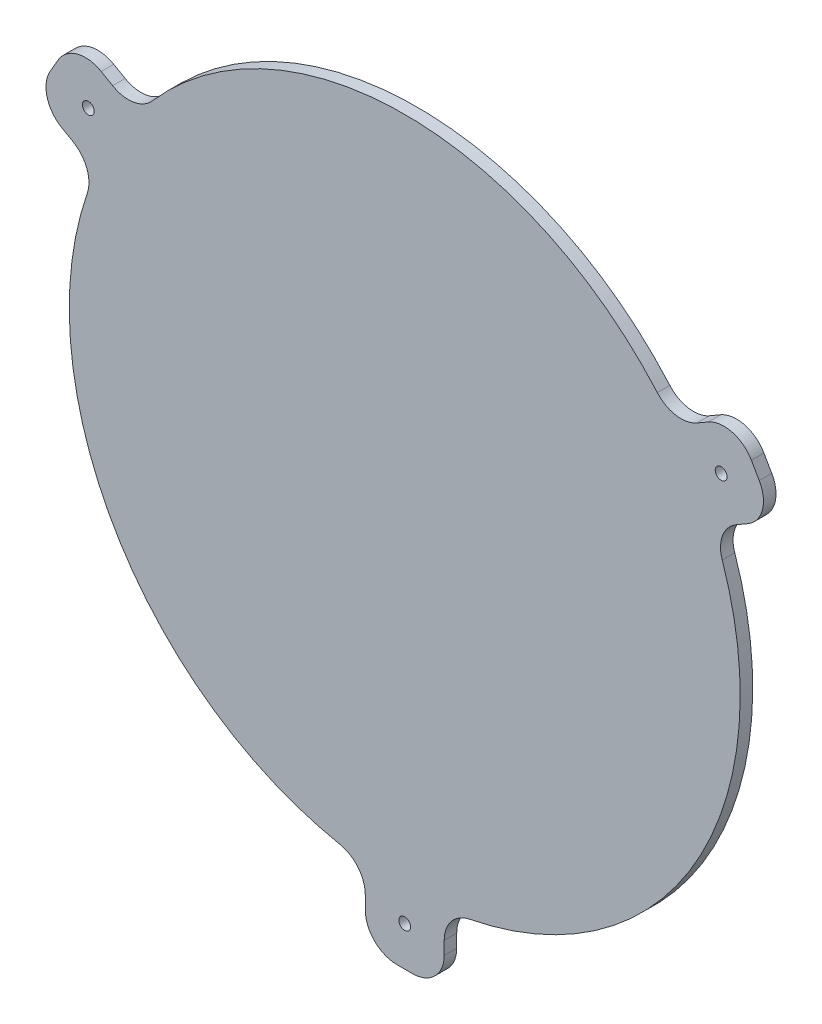
ISO-10303-21;
HEADER;
FILE_DESCRIPTION(('STEP AP214'),'2;1');
FILE_NAME('part.step','',(''),(''),'','','');
FILE_SCHEMA(('AUTOMOTIVE_DESIGN { 1 0 10303 214 1 1 1 1 }'));
ENDSEC;
DATA;
#1=APPLICATION_CONTEXT('core data for automotive mechanical design processes');
#2=APPLICATION_PROTOCOL_DEFINITION('international standard','automotive_design',2000,#1);
#3=PRODUCT_CONTEXT('',#1,'mechanical');
#4=PRODUCT('Part','Part','',(#3));
#5=PRODUCT_RELATED_PRODUCT_CATEGORY('part','',(#4));
#6=PRODUCT_DEFINITION_FORMATION('','',#4);
#7=PRODUCT_DEFINITION_CONTEXT('part definition',#1,'design');
#8=PRODUCT_DEFINITION('design','',#6,#7);
#9=PRODUCT_DEFINITION_SHAPE('','',#8);
#10=(LENGTH_UNIT() NAMED_UNIT(*) SI_UNIT(.MILLI.,.METRE.));
#11=(NAMED_UNIT(*) PLANE_ANGLE_UNIT() SI_UNIT($,.RADIAN.));
#12=(NAMED_UNIT(*) SI_UNIT($,.STERADIAN.) SOLID_ANGLE_UNIT());
#13=UNCERTAINTY_MEASURE_WITH_UNIT(LENGTH_MEASURE(1.E-05),#10,'distance_accuracy_value','');
#14=(GEOMETRIC_REPRESENTATION_CONTEXT(3) GLOBAL_UNCERTAINTY_ASSIGNED_CONTEXT((#13)) GLOBAL_UNIT_ASSIGNED_CONTEXT((#10,
#11,#12)) REPRESENTATION_CONTEXT('',''));
#15=CARTESIAN_POINT('',(0.,0.,0.));
#16=DIRECTION('',(0.,0.,1.));
#17=DIRECTION('',(1.,0.,0.));
#18=AXIS2_PLACEMENT_3D('',#15,#16,#17);
#19=CARTESIAN_POINT('',(0.,0.,3.175));
#20=DIRECTION('',(0.,0.,-1.));
#21=DIRECTION('',(-1.,0.,0.));
#22=AXIS2_PLACEMENT_3D('',#19,#20,#21);
#23=CYLINDRICAL_SURFACE('',#22,85.);
#24=CARTESIAN_POINT('',(0.,0.,0.));
#25=DIRECTION('',(0.,0.,1.));
#26=DIRECTION('',(1.,0.,0.));
#27=AXIS2_PLACEMENT_3D('',#24,#25,#26);
#28=CIRCLE('',#27,85.);
#29=CARTESIAN_POINT('',(63.9944007252,55.9438707618853,0.));
#30=VERTEX_POINT('',#29);
#31=CARTESIAN_POINT('',(-63.9944007252008,55.9438707618844,0.));
#32=VERTEX_POINT('',#31);
#33=EDGE_CURVE('E250',#30,#32,#28,.T.);
#34=ORIENTED_EDGE('',*,*,#33,.T.);
#35=DIRECTION('',(0.,0.,-1.));
#36=VECTOR('',#35,1.);
#37=CARTESIAN_POINT('',(-63.9944007252008,55.9438707618844,3.175));
#38=LINE('',#37,#36);
#39=CARTESIAN_POINT('',(-63.9944007252008,55.9438707618844,3.175));
#40=VERTEX_POINT('',#39);
#41=EDGE_CURVE('E318',#32,#40,#38,.F.);
#42=ORIENTED_EDGE('',*,*,#41,.T.);
#43=CARTESIAN_POINT('',(0.,0.,3.175));
#44=DIRECTION('',(0.,0.,1.));
#45=DIRECTION('',(1.,0.,0.));
#46=AXIS2_PLACEMENT_3D('',#43,#44,#45);
#47=CIRCLE('',#46,85.);
#48=CARTESIAN_POINT('',(63.9944007252,55.9438707618853,3.175));
#49=VERTEX_POINT('',#48);
#50=EDGE_CURVE('E245',#49,#40,#47,.T.);
#51=ORIENTED_EDGE('',*,*,#50,.F.);
#52=DIRECTION('',(0.,0.,-1.));
#53=VECTOR('',#52,1.);
#54=CARTESIAN_POINT('',(63.9944007252,55.9438707618853,3.175));
#55=LINE('',#54,#53);
#56=EDGE_CURVE('E284',#49,#30,#55,.T.);
#57=ORIENTED_EDGE('',*,*,#56,.T.);
#58=EDGE_LOOP('',(#34,#42,#51,#57));
#59=FACE_BOUND('',#58,.T.);
#60=ADVANCED_FACE('F35',(#59),#23,.T.);
#61=CARTESIAN_POINT('',(-80.4460136284263,27.4488413470414,3.175));
#62=VERTEX_POINT('',#61);
#63=CARTESIAN_POINT('',(-16.4516129032258,-83.3927121089272,3.175));
#64=VERTEX_POINT('',#63);
#65=EDGE_CURVE('E246',#62,#64,#47,.T.);
#66=ORIENTED_EDGE('',*,*,#65,.F.);
#67=DIRECTION('',(0.,0.,-1.));
#68=VECTOR('',#67,1.);
#69=CARTESIAN_POINT('',(-80.4460136284263,27.4488413470414,3.175));
#70=LINE('',#69,#68);
#71=CARTESIAN_POINT('',(-80.4460136284263,27.4488413470414,0.));
#72=VERTEX_POINT('',#71);
#73=EDGE_CURVE('E320',#62,#72,#70,.T.);
#74=ORIENTED_EDGE('',*,*,#73,.T.);
#75=CARTESIAN_POINT('',(-16.4516129032258,-83.3927121089272,0.));
#76=VERTEX_POINT('',#75);
#77=EDGE_CURVE('E251',#72,#76,#28,.T.);
#78=ORIENTED_EDGE('',*,*,#77,.T.);
#79=DIRECTION('',(0.,0.,-1.));
#80=VECTOR('',#79,1.);
#81=CARTESIAN_POINT('',(-16.4516129032258,-83.3927121089273,3.175));
#82=LINE('',#81,#80);
#83=EDGE_CURVE('E204',#76,#64,#82,.F.);
#84=ORIENTED_EDGE('',*,*,#83,.T.);
#85=EDGE_LOOP('',(#66,#74,#78,#84));
#86=FACE_BOUND('',#85,.T.);
#87=ADVANCED_FACE('F363',(#86),#23,.T.);
#88=CARTESIAN_POINT('',(16.4516129032258,-83.3927121089272,0.));
#89=VERTEX_POINT('',#88);
#90=CARTESIAN_POINT('',(80.4460136284259,27.4488413470426,0.));
#91=VERTEX_POINT('',#90);
#92=EDGE_CURVE('E247',#89,#91,#28,.T.);
#93=ORIENTED_EDGE('',*,*,#92,.T.);
#94=DIRECTION('',(0.,0.,-1.));
#95=VECTOR('',#94,1.);
#96=CARTESIAN_POINT('',(80.4460136284259,27.4488413470426,3.175));
#97=LINE('',#96,#95);
#98=CARTESIAN_POINT('',(80.4460136284259,27.4488413470426,3.175));
#99=VERTEX_POINT('',#98);
#100=EDGE_CURVE('E282',#91,#99,#97,.F.);
#101=ORIENTED_EDGE('',*,*,#100,.T.);
#102=CARTESIAN_POINT('',(16.4516129032258,-83.3927121089272,3.175));
#103=VERTEX_POINT('',#102);
#104=EDGE_CURVE('E242',#103,#99,#47,.T.);
#105=ORIENTED_EDGE('',*,*,#104,.F.);
#106=DIRECTION('',(0.,0.,-1.));
#107=VECTOR('',#106,1.);
#108=CARTESIAN_POINT('',(16.4516129032258,-83.3927121089272,3.175));
#109=LINE('',#108,#107);
#110=EDGE_CURVE('E219',#103,#89,#109,.T.);
#111=ORIENTED_EDGE('',*,*,#110,.T.);
#112=EDGE_LOOP('',(#93,#101,#105,#111));
#113=FACE_BOUND('',#112,.T.);
#114=ADVANCED_FACE('F449',(#113),#23,.T.);
#115=CARTESIAN_POINT('',(0.,0.,3.175));
#116=DIRECTION('',(0.,0.,1.));
#117=DIRECTION('',(1.,0.,0.));
#118=AXIS2_PLACEMENT_3D('',#115,#116,#117);
#119=PLANE('',#118);
#120=DIRECTION('',(-0.866025403784443,0.499999999999992,0.));
#121=VECTOR('',#120,1.);
#122=CARTESIAN_POINT('',(-68.1009575860677,50.8651115781791,3.175));
#123=LINE('',#122,#121);
#124=CARTESIAN_POINT('',(-74.0174031463961,54.2809730150803,3.175));
#125=VERTEX_POINT('',#124);
#126=CARTESIAN_POINT('',(-76.9000224358949,55.9452540378437,3.175));
#127=VERTEX_POINT('',#126);
#128=EDGE_CURVE('E353',#125,#127,#123,.T.);
#129=ORIENTED_EDGE('',*,*,#128,.T.);
#130=CARTESIAN_POINT('',(-80.9000224358948,49.0170508075681,3.175));
#131=DIRECTION('',(0.,0.,1.));
#132=DIRECTION('',(1.,0.,0.));
#133=AXIS2_PLACEMENT_3D('',#130,#131,#132);
#134=CIRCLE('',#133,8.);
#135=CARTESIAN_POINT('',(-87.8282256661704,53.017050807568,3.175));
#136=VERTEX_POINT('',#135);
#137=EDGE_CURVE('E57',#127,#136,#134,.T.);
#138=ORIENTED_EDGE('',*,*,#137,.T.);
#139=DIRECTION('',(-0.499999999999992,-0.866025403784443,0.));
#140=VECTOR('',#139,1.);
#141=CARTESIAN_POINT('',(-83.8282256661704,59.9452540378436,3.175));
#142=LINE('',#141,#140);
#143=CARTESIAN_POINT('',(-89.8282256661703,49.5529491924303,3.175));
#144=VERTEX_POINT('',#143);
#145=EDGE_CURVE('E500',#136,#144,#142,.T.);
#146=ORIENTED_EDGE('',*,*,#145,.T.);
#147=CARTESIAN_POINT('',(-82.9000224358948,45.5529491924303,3.175));
#148=DIRECTION('',(0.,0.,1.));
#149=DIRECTION('',(1.,0.,0.));
#150=AXIS2_PLACEMENT_3D('',#147,#148,#149);
#151=CIRCLE('',#150,8.);
#152=CARTESIAN_POINT('',(-86.9000224358947,38.6247459621548,3.175));
#153=VERTEX_POINT('',#152);
#154=EDGE_CURVE('E336',#144,#153,#151,.T.);
#155=ORIENTED_EDGE('',*,*,#154,.T.);
#156=DIRECTION('',(0.866025403784443,-0.499999999999992,0.));
#157=VECTOR('',#156,1.);
#158=CARTESIAN_POINT('',(-78.1009575860676,33.5446035024902,3.175));
#159=LINE('',#158,#157);
#160=CARTESIAN_POINT('',(-84.0174031463959,36.9604649393915,3.175));
#161=VERTEX_POINT('',#160);
#162=EDGE_CURVE('E361',#153,#161,#159,.T.);
#163=ORIENTED_EDGE('',*,*,#162,.T.);
#164=CARTESIAN_POINT('',(-88.0174031463959,30.0322617091159,3.175));
#165=DIRECTION('',(0.,0.,1.));
#166=DIRECTION('',(1.,0.,0.));
#167=AXIS2_PLACEMENT_3D('',#164,#165,#166);
#168=CIRCLE('',#167,8.);
#169=EDGE_CURVE('E11',#161,#62,#168,.F.);
#170=ORIENTED_EDGE('',*,*,#169,.T.);
#171=ORIENTED_EDGE('',*,*,#65,.T.);
#172=CARTESIAN_POINT('',(-18.,-91.2414379544733,3.175));
#173=DIRECTION('',(0.,0.,1.));
#174=DIRECTION('',(1.,0.,0.));
#175=AXIS2_PLACEMENT_3D('',#172,#173,#174);
#176=CIRCLE('',#175,8.);
#177=CARTESIAN_POINT('',(-9.99999999999999,-91.2414379544733,3.175));
#178=VERTEX_POINT('',#177);
#179=EDGE_CURVE('E208',#64,#178,#176,.F.);
#180=ORIENTED_EDGE('',*,*,#179,.T.);
#181=DIRECTION('',(0.,-1.,0.));
#182=VECTOR('',#181,1.);
#183=CARTESIAN_POINT('',(-9.99999999999999,-84.4097150806707,3.175));
#184=LINE('',#183,#182);
#185=CARTESIAN_POINT('',(-9.99999999999999,-94.57,3.175));
#186=VERTEX_POINT('',#185);
#187=EDGE_CURVE('E218',#178,#186,#184,.T.);
#188=ORIENTED_EDGE('',*,*,#187,.T.);
#189=CARTESIAN_POINT('',(-1.99999999999999,-94.57,3.175));
#190=DIRECTION('',(0.,0.,1.));
#191=DIRECTION('',(1.,0.,0.));
#192=AXIS2_PLACEMENT_3D('',#189,#190,#191);
#193=CIRCLE('',#192,8.);
#194=CARTESIAN_POINT('',(-1.99999999999999,-102.57,3.175));
#195=VERTEX_POINT('',#194);
#196=EDGE_CURVE('E209',#186,#195,#193,.T.);
#197=ORIENTED_EDGE('',*,*,#196,.T.);
#198=DIRECTION('',(1.,0.,0.));
#199=VECTOR('',#198,1.);
#200=CARTESIAN_POINT('',(-9.99999999999999,-102.57,3.175));
#201=LINE('',#200,#199);
#202=CARTESIAN_POINT('',(2.00000000000001,-102.57,3.175));
#203=VERTEX_POINT('',#202);
#204=EDGE_CURVE('E418',#195,#203,#201,.T.);
#205=ORIENTED_EDGE('',*,*,#204,.T.);
#206=CARTESIAN_POINT('',(2.00000000000001,-94.57,3.175));
#207=DIRECTION('',(0.,0.,1.));
#208=DIRECTION('',(1.,0.,0.));
#209=AXIS2_PLACEMENT_3D('',#206,#207,#208);
#210=CIRCLE('',#209,8.);
#211=CARTESIAN_POINT('',(10.,-94.57,3.175));
#212=VERTEX_POINT('',#211);
#213=EDGE_CURVE('E269',#203,#212,#210,.T.);
#214=ORIENTED_EDGE('',*,*,#213,.T.);
#215=DIRECTION('',(0.,1.,0.));
#216=VECTOR('',#215,1.);
#217=CARTESIAN_POINT('',(10.,-84.4097150806707,3.175));
#218=LINE('',#217,#216);
#219=CARTESIAN_POINT('',(10.,-91.2414379544733,3.175));
#220=VERTEX_POINT('',#219);
#221=EDGE_CURVE('E237',#212,#220,#218,.T.);
#222=ORIENTED_EDGE('',*,*,#221,.T.);
#223=CARTESIAN_POINT('',(18.,-91.2414379544733,3.175));
#224=DIRECTION('',(0.,0.,1.));
#225=DIRECTION('',(1.,0.,0.));
#226=AXIS2_PLACEMENT_3D('',#223,#224,#225);
#227=CIRCLE('',#226,8.);
#228=EDGE_CURVE('E275',#220,#103,#227,.F.);
#229=ORIENTED_EDGE('',*,*,#228,.T.);
#230=ORIENTED_EDGE('',*,*,#104,.T.);
#231=CARTESIAN_POINT('',(88.0174031463954,30.0322617091172,3.175));
#232=DIRECTION('',(0.,0.,1.));
#233=DIRECTION('',(1.,0.,0.));
#234=AXIS2_PLACEMENT_3D('',#231,#232,#233);
#235=CIRCLE('',#234,8.);
#236=CARTESIAN_POINT('',(84.0174031463954,36.9604649393927,3.175));
#237=VERTEX_POINT('',#236);
#238=EDGE_CURVE('E307',#99,#237,#235,.F.);
#239=ORIENTED_EDGE('',*,*,#238,.T.);
#240=DIRECTION('',(0.866025403784436,0.500000000000004,0.));
#241=VECTOR('',#240,1.);
#242=CARTESIAN_POINT('',(78.1009575860671,33.5446035024913,3.175));
#243=LINE('',#242,#241);
#244=CARTESIAN_POINT('',(86.9000224358942,38.624745962156,3.175));
#245=VERTEX_POINT('',#244);
#246=EDGE_CURVE('E400',#237,#245,#243,.T.);
#247=ORIENTED_EDGE('',*,*,#246,.T.);
#248=CARTESIAN_POINT('',(82.9000224358942,45.5529491924315,3.175));
#249=DIRECTION('',(0.,0.,1.));
#250=DIRECTION('',(1.,0.,0.));
#251=AXIS2_PLACEMENT_3D('',#248,#249,#250);
#252=CIRCLE('',#251,8.);
#253=CARTESIAN_POINT('',(89.8282256661696,49.5529491924316,3.175));
#254=VERTEX_POINT('',#253);
#255=EDGE_CURVE('E303',#245,#254,#252,.T.);
#256=ORIENTED_EDGE('',*,*,#255,.T.);
#257=DIRECTION('',(-0.500000000000004,0.866025403784436,0.));
#258=VECTOR('',#257,1.);
#259=CARTESIAN_POINT('',(93.8282256661697,42.6247459621561,3.175));
#260=LINE('',#259,#258);
#261=CARTESIAN_POINT('',(87.8282256661696,53.0170508075693,3.175));
#262=VERTEX_POINT('',#261);
#263=EDGE_CURVE('E403',#254,#262,#260,.T.);
#264=ORIENTED_EDGE('',*,*,#263,.T.);
#265=CARTESIAN_POINT('',(80.9000224358941,49.0170508075693,3.175));
#266=DIRECTION('',(0.,0.,1.));
#267=DIRECTION('',(1.,0.,0.));
#268=AXIS2_PLACEMENT_3D('',#265,#266,#267);
#269=CIRCLE('',#268,8.);
#270=CARTESIAN_POINT('',(76.9000224358941,55.9452540378448,3.175));
#271=VERTEX_POINT('',#270);
#272=EDGE_CURVE('E301',#262,#271,#269,.T.);
#273=ORIENTED_EDGE('',*,*,#272,.T.);
#274=DIRECTION('',(-0.866025403784436,-0.500000000000004,0.));
#275=VECTOR('',#274,1.);
#276=CARTESIAN_POINT('',(68.100957586067,50.8651115781801,3.175));
#277=LINE('',#276,#275);
#278=CARTESIAN_POINT('',(74.0174031463953,54.2809730150814,3.175));
#279=VERTEX_POINT('',#278);
#280=EDGE_CURVE('E407',#271,#279,#277,.T.);
#281=ORIENTED_EDGE('',*,*,#280,.T.);
#282=CARTESIAN_POINT('',(70.0174031463953,61.2091762453569,3.175));
#283=DIRECTION('',(0.,0.,1.));
#284=DIRECTION('',(1.,0.,0.));
#285=AXIS2_PLACEMENT_3D('',#282,#283,#284);
#286=CIRCLE('',#285,8.);
#287=EDGE_CURVE('E311',#279,#49,#286,.F.);
#288=ORIENTED_EDGE('',*,*,#287,.T.);
#289=ORIENTED_EDGE('',*,*,#50,.T.);
#290=CARTESIAN_POINT('',(-70.0174031463961,61.2091762453559,3.175));
#291=DIRECTION('',(0.,0.,1.));
#292=DIRECTION('',(1.,0.,0.));
#293=AXIS2_PLACEMENT_3D('',#290,#291,#292);
#294=CIRCLE('',#293,8.);
#295=EDGE_CURVE('E341',#40,#125,#294,.F.);
#296=ORIENTED_EDGE('',*,*,#295,.T.);
#297=EDGE_LOOP('',(#129,#138,#146,#155,#163,#170,#171,#180,#188,#197,#205,#214,#222,#229,#230,
#239,#247,#256,#264,#273,#281,#288,#289,#296));
#298=FACE_BOUND('',#297,.T.);
#299=CARTESIAN_POINT('',(80.1679716283253,46.2850000000004,3.175));
#300=DIRECTION('',(0.,0.,1.));
#301=DIRECTION('',(-0.500000000000004,0.866025403784436,0.));
#302=AXIS2_PLACEMENT_3D('',#299,#300,#301);
#303=CIRCLE('',#302,1.5);
#304=CARTESIAN_POINT('',(79.4179716283253,47.584038105677,3.175));
#305=VERTEX_POINT('',#304);
#306=EDGE_CURVE('E393',#305,#305,#303,.T.);
#307=ORIENTED_EDGE('',*,*,#306,.F.);
#308=EDGE_LOOP('',(#307));
#309=FACE_BOUND('',#308,.T.);
#310=CARTESIAN_POINT('',(0.,-92.57,3.175));
#311=DIRECTION('',(0.,0.,1.));
#312=DIRECTION('',(1.,0.,0.));
#313=AXIS2_PLACEMENT_3D('',#310,#311,#312);
#314=CIRCLE('',#313,1.5);
#315=CARTESIAN_POINT('',(1.5,-92.57,3.175));
#316=VERTEX_POINT('',#315);
#317=EDGE_CURVE('E228',#316,#316,#314,.T.);
#318=ORIENTED_EDGE('',*,*,#317,.F.);
#319=EDGE_LOOP('',(#318));
#320=FACE_BOUND('',#319,.T.);
#321=CARTESIAN_POINT('',(-80.1679716283259,46.2849999999993,3.175));
#322=DIRECTION('',(0.,0.,1.));
#323=DIRECTION('',(-0.499999999999992,-0.866025403784443,0.));
#324=AXIS2_PLACEMENT_3D('',#321,#322,#323);
#325=CIRCLE('',#324,1.5);
#326=CARTESIAN_POINT('',(-80.9179716283259,44.9859618943226,3.175));
#327=VERTEX_POINT('',#326);
#328=EDGE_CURVE('E384',#327,#327,#325,.T.);
#329=ORIENTED_EDGE('',*,*,#328,.F.);
#330=EDGE_LOOP('',(#329));
#331=FACE_BOUND('',#330,.T.);
#332=ADVANCED_FACE('F359',(#298,#309,#320,#331),#119,.T.);
#333=CARTESIAN_POINT('',(0.,0.,0.));
#334=DIRECTION('',(0.,0.,1.));
#335=DIRECTION('',(1.,0.,0.));
#336=AXIS2_PLACEMENT_3D('',#333,#334,#335);
#337=PLANE('',#336);
#338=DIRECTION('',(-0.499999999999992,-0.866025403784443,0.));
#339=VECTOR('',#338,1.);
#340=CARTESIAN_POINT('',(-83.8282256661704,59.9452540378436,0.));
#341=LINE('',#340,#339);
#342=CARTESIAN_POINT('',(-87.8282256661704,53.017050807568,0.));
#343=VERTEX_POINT('',#342);
#344=CARTESIAN_POINT('',(-89.8282256661703,49.5529491924303,0.));
#345=VERTEX_POINT('',#344);
#346=EDGE_CURVE('E354',#343,#345,#341,.T.);
#347=ORIENTED_EDGE('',*,*,#346,.F.);
#348=CARTESIAN_POINT('',(-80.9000224358948,49.0170508075681,0.));
#349=DIRECTION('',(0.,0.,1.));
#350=DIRECTION('',(1.,0.,0.));
#351=AXIS2_PLACEMENT_3D('',#348,#349,#350);
#352=CIRCLE('',#351,8.);
#353=CARTESIAN_POINT('',(-76.9000224358949,55.9452540378437,0.));
#354=VERTEX_POINT('',#353);
#355=EDGE_CURVE('E334',#343,#354,#352,.F.);
#356=ORIENTED_EDGE('',*,*,#355,.T.);
#357=DIRECTION('',(-0.866025403784443,0.499999999999992,0.));
#358=VECTOR('',#357,1.);
#359=CARTESIAN_POINT('',(-68.1009575860677,50.8651115781791,0.));
#360=LINE('',#359,#358);
#361=CARTESIAN_POINT('',(-74.0174031463961,54.2809730150803,0.));
#362=VERTEX_POINT('',#361);
#363=EDGE_CURVE('E380',#362,#354,#360,.T.);
#364=ORIENTED_EDGE('',*,*,#363,.F.);
#365=CARTESIAN_POINT('',(-70.0174031463961,61.2091762453559,0.));
#366=DIRECTION('',(0.,0.,1.));
#367=DIRECTION('',(1.,0.,0.));
#368=AXIS2_PLACEMENT_3D('',#365,#366,#367);
#369=CIRCLE('',#368,8.);
#370=EDGE_CURVE('E339',#362,#32,#369,.T.);
#371=ORIENTED_EDGE('',*,*,#370,.T.);
#372=ORIENTED_EDGE('',*,*,#33,.F.);
#373=CARTESIAN_POINT('',(70.0174031463953,61.2091762453569,0.));
#374=DIRECTION('',(0.,0.,1.));
#375=DIRECTION('',(1.,0.,0.));
#376=AXIS2_PLACEMENT_3D('',#373,#374,#375);
#377=CIRCLE('',#376,8.);
#378=CARTESIAN_POINT('',(74.0174031463953,54.2809730150814,0.));
#379=VERTEX_POINT('',#378);
#380=EDGE_CURVE('E309',#30,#379,#377,.T.);
#381=ORIENTED_EDGE('',*,*,#380,.T.);
#382=DIRECTION('',(-0.866025403784436,-0.500000000000004,0.));
#383=VECTOR('',#382,1.);
#384=CARTESIAN_POINT('',(68.100957586067,50.8651115781801,0.));
#385=LINE('',#384,#383);
#386=CARTESIAN_POINT('',(76.9000224358941,55.9452540378448,0.));
#387=VERTEX_POINT('',#386);
#388=EDGE_CURVE('E404',#387,#379,#385,.T.);
#389=ORIENTED_EDGE('',*,*,#388,.F.);
#390=CARTESIAN_POINT('',(80.9000224358941,49.0170508075693,0.));
#391=DIRECTION('',(0.,0.,1.));
#392=DIRECTION('',(1.,0.,0.));
#393=AXIS2_PLACEMENT_3D('',#390,#391,#392);
#394=CIRCLE('',#393,8.);
#395=CARTESIAN_POINT('',(87.8282256661696,53.0170508075693,0.));
#396=VERTEX_POINT('',#395);
#397=EDGE_CURVE('E297',#387,#396,#394,.F.);
#398=ORIENTED_EDGE('',*,*,#397,.T.);
#399=DIRECTION('',(-0.500000000000004,0.866025403784436,0.));
#400=VECTOR('',#399,1.);
#401=CARTESIAN_POINT('',(93.8282256661697,42.6247459621561,0.));
#402=LINE('',#401,#400);
#403=CARTESIAN_POINT('',(89.8282256661696,49.5529491924316,0.));
#404=VERTEX_POINT('',#403);
#405=EDGE_CURVE('E411',#404,#396,#402,.T.);
#406=ORIENTED_EDGE('',*,*,#405,.F.);
#407=CARTESIAN_POINT('',(82.9000224358942,45.5529491924315,0.));
#408=DIRECTION('',(0.,0.,1.));
#409=DIRECTION('',(1.,0.,0.));
#410=AXIS2_PLACEMENT_3D('',#407,#408,#409);
#411=CIRCLE('',#410,8.);
#412=CARTESIAN_POINT('',(86.9000224358942,38.624745962156,0.));
#413=VERTEX_POINT('',#412);
#414=EDGE_CURVE('E299',#404,#413,#411,.F.);
#415=ORIENTED_EDGE('',*,*,#414,.T.);
#416=DIRECTION('',(0.866025403784436,0.500000000000004,0.));
#417=VECTOR('',#416,1.);
#418=CARTESIAN_POINT('',(78.1009575860671,33.5446035024913,0.));
#419=LINE('',#418,#417);
#420=CARTESIAN_POINT('',(84.0174031463954,36.9604649393927,0.));
#421=VERTEX_POINT('',#420);
#422=EDGE_CURVE('E396',#421,#413,#419,.T.);
#423=ORIENTED_EDGE('',*,*,#422,.F.);
#424=CARTESIAN_POINT('',(88.0174031463954,30.0322617091172,0.));
#425=DIRECTION('',(0.,0.,1.));
#426=DIRECTION('',(1.,0.,0.));
#427=AXIS2_PLACEMENT_3D('',#424,#425,#426);
#428=CIRCLE('',#427,8.);
#429=EDGE_CURVE('E305',#421,#91,#428,.T.);
#430=ORIENTED_EDGE('',*,*,#429,.T.);
#431=ORIENTED_EDGE('',*,*,#92,.F.);
#432=CARTESIAN_POINT('',(18.,-91.2414379544733,0.));
#433=DIRECTION('',(0.,0.,1.));
#434=DIRECTION('',(1.,0.,0.));
#435=AXIS2_PLACEMENT_3D('',#432,#433,#434);
#436=CIRCLE('',#435,8.);
#437=CARTESIAN_POINT('',(10.,-91.2414379544733,0.));
#438=VERTEX_POINT('',#437);
#439=EDGE_CURVE('E273',#89,#438,#436,.T.);
#440=ORIENTED_EDGE('',*,*,#439,.T.);
#441=DIRECTION('',(0.,1.,0.));
#442=VECTOR('',#441,1.);
#443=CARTESIAN_POINT('',(10.,-84.4097150806707,0.));
#444=LINE('',#443,#442);
#445=CARTESIAN_POINT('',(10.,-94.57,0.));
#446=VERTEX_POINT('',#445);
#447=EDGE_CURVE('E231',#446,#438,#444,.T.);
#448=ORIENTED_EDGE('',*,*,#447,.F.);
#449=CARTESIAN_POINT('',(2.00000000000001,-94.57,0.));
#450=DIRECTION('',(0.,0.,1.));
#451=DIRECTION('',(1.,0.,0.));
#452=AXIS2_PLACEMENT_3D('',#449,#450,#451);
#453=CIRCLE('',#452,8.);
#454=CARTESIAN_POINT('',(2.00000000000001,-102.57,0.));
#455=VERTEX_POINT('',#454);
#456=EDGE_CURVE('E266',#446,#455,#453,.F.);
#457=ORIENTED_EDGE('',*,*,#456,.T.);
#458=DIRECTION('',(1.,0.,0.));
#459=VECTOR('',#458,1.);
#460=CARTESIAN_POINT('',(-9.99999999999999,-102.57,0.));
#461=LINE('',#460,#459);
#462=CARTESIAN_POINT('',(-1.99999999999999,-102.57,0.));
#463=VERTEX_POINT('',#462);
#464=EDGE_CURVE('E227',#463,#455,#461,.T.);
#465=ORIENTED_EDGE('',*,*,#464,.F.);
#466=CARTESIAN_POINT('',(-1.99999999999999,-94.57,0.));
#467=DIRECTION('',(0.,0.,1.));
#468=DIRECTION('',(1.,0.,0.));
#469=AXIS2_PLACEMENT_3D('',#466,#467,#468);
#470=CIRCLE('',#469,8.);
#471=CARTESIAN_POINT('',(-9.99999999999999,-94.57,0.));
#472=VERTEX_POINT('',#471);
#473=EDGE_CURVE('E226',#463,#472,#470,.F.);
#474=ORIENTED_EDGE('',*,*,#473,.T.);
#475=DIRECTION('',(0.,-1.,0.));
#476=VECTOR('',#475,1.);
#477=CARTESIAN_POINT('',(-9.99999999999999,-84.4097150806707,0.));
#478=LINE('',#477,#476);
#479=CARTESIAN_POINT('',(-9.99999999999999,-91.2414379544733,0.));
#480=VERTEX_POINT('',#479);
#481=EDGE_CURVE('E215',#480,#472,#478,.T.);
#482=ORIENTED_EDGE('',*,*,#481,.F.);
#483=CARTESIAN_POINT('',(-18.,-91.2414379544733,0.));
#484=DIRECTION('',(0.,0.,1.));
#485=DIRECTION('',(1.,0.,0.));
#486=AXIS2_PLACEMENT_3D('',#483,#484,#485);
#487=CIRCLE('',#486,8.);
#488=EDGE_CURVE('E198',#480,#76,#487,.T.);
#489=ORIENTED_EDGE('',*,*,#488,.T.);
#490=ORIENTED_EDGE('',*,*,#77,.F.);
#491=CARTESIAN_POINT('',(-88.0174031463959,30.0322617091159,0.));
#492=DIRECTION('',(0.,0.,1.));
#493=DIRECTION('',(1.,0.,0.));
#494=AXIS2_PLACEMENT_3D('',#491,#492,#493);
#495=CIRCLE('',#494,8.);
#496=CARTESIAN_POINT('',(-84.0174031463959,36.9604649393915,0.));
#497=VERTEX_POINT('',#496);
#498=EDGE_CURVE('E43',#72,#497,#495,.T.);
#499=ORIENTED_EDGE('',*,*,#498,.T.);
#500=DIRECTION('',(0.866025403784443,-0.499999999999992,0.));
#501=VECTOR('',#500,1.);
#502=CARTESIAN_POINT('',(-78.1009575860676,33.5446035024902,0.));
#503=LINE('',#502,#501);
#504=CARTESIAN_POINT('',(-86.9000224358947,38.6247459621548,0.));
#505=VERTEX_POINT('',#504);
#506=EDGE_CURVE('E344',#505,#497,#503,.T.);
#507=ORIENTED_EDGE('',*,*,#506,.F.);
#508=CARTESIAN_POINT('',(-82.9000224358948,45.5529491924303,0.));
#509=DIRECTION('',(0.,0.,1.));
#510=DIRECTION('',(1.,0.,0.));
#511=AXIS2_PLACEMENT_3D('',#508,#509,#510);
#512=CIRCLE('',#511,8.);
#513=EDGE_CURVE('E332',#505,#345,#512,.F.);
#514=ORIENTED_EDGE('',*,*,#513,.T.);
#515=EDGE_LOOP('',(#347,#356,#364,#371,#372,#381,#389,#398,#406,#415,#423,#430,#431,#440,#448,
#457,#465,#474,#482,#489,#490,#499,#507,#514));
#516=FACE_BOUND('',#515,.T.);
#517=CARTESIAN_POINT('',(80.1679716283253,46.2850000000004,0.));
#518=DIRECTION('',(0.,0.,1.));
#519=DIRECTION('',(-0.500000000000004,0.866025403784436,0.));
#520=AXIS2_PLACEMENT_3D('',#517,#518,#519);
#521=CIRCLE('',#520,1.5);
#522=CARTESIAN_POINT('',(79.4179716283253,47.584038105677,0.));
#523=VERTEX_POINT('',#522);
#524=EDGE_CURVE('E397',#523,#523,#521,.T.);
#525=ORIENTED_EDGE('',*,*,#524,.T.);
#526=EDGE_LOOP('',(#525));
#527=FACE_BOUND('',#526,.T.);
#528=CARTESIAN_POINT('',(0.,-92.57,0.));
#529=DIRECTION('',(0.,0.,1.));
#530=DIRECTION('',(1.,0.,0.));
#531=AXIS2_PLACEMENT_3D('',#528,#529,#530);
#532=CIRCLE('',#531,1.5);
#533=CARTESIAN_POINT('',(1.5,-92.57,0.));
#534=VERTEX_POINT('',#533);
#535=EDGE_CURVE('E234',#534,#534,#532,.T.);
#536=ORIENTED_EDGE('',*,*,#535,.T.);
#537=EDGE_LOOP('',(#536));
#538=FACE_BOUND('',#537,.T.);
#539=CARTESIAN_POINT('',(-80.1679716283259,46.2849999999993,0.));
#540=DIRECTION('',(0.,0.,1.));
#541=DIRECTION('',(-0.499999999999992,-0.866025403784443,0.));
#542=AXIS2_PLACEMENT_3D('',#539,#540,#541);
#543=CIRCLE('',#542,1.5);
#544=CARTESIAN_POINT('',(-80.9179716283259,44.9859618943226,0.));
#545=VERTEX_POINT('',#544);
#546=EDGE_CURVE('E388',#545,#545,#543,.T.);
#547=ORIENTED_EDGE('',*,*,#546,.T.);
#548=EDGE_LOOP('',(#547));
#549=FACE_BOUND('',#548,.T.);
#550=ADVANCED_FACE('F223',(#516,#527,#538,#549),#337,.F.);
#551=CARTESIAN_POINT('',(-9.99999999999999,-84.4097150806707,3.175));
#552=DIRECTION('',(1.,0.,0.));
#553=DIRECTION('',(0.,0.,-1.));
#554=AXIS2_PLACEMENT_3D('',#551,#552,#553);
#555=PLANE('',#554);
#556=ORIENTED_EDGE('',*,*,#187,.F.);
#557=DIRECTION('',(0.,0.,1.));
#558=VECTOR('',#557,1.);
#559=CARTESIAN_POINT('',(-9.99999999999999,-91.2414379544733,0.));
#560=LINE('',#559,#558);
#561=EDGE_CURVE('E202',#178,#480,#560,.F.);
#562=ORIENTED_EDGE('',*,*,#561,.T.);
#563=ORIENTED_EDGE('',*,*,#481,.T.);
#564=DIRECTION('',(0.,0.,-1.));
#565=VECTOR('',#564,1.);
#566=CARTESIAN_POINT('',(-9.99999999999999,-94.57,3.175));
#567=LINE('',#566,#565);
#568=EDGE_CURVE('E220',#472,#186,#567,.F.);
#569=ORIENTED_EDGE('',*,*,#568,.T.);
#570=EDGE_LOOP('',(#556,#562,#563,#569));
#571=FACE_BOUND('',#570,.T.);
#572=ADVANCED_FACE('F214',(#571),#555,.F.);
#573=CARTESIAN_POINT('',(-9.99999999999999,-102.57,3.175));
#574=DIRECTION('',(0.,1.,0.));
#575=DIRECTION('',(0.,0.,1.));
#576=AXIS2_PLACEMENT_3D('',#573,#574,#575);
#577=PLANE('',#576);
#578=ORIENTED_EDGE('',*,*,#204,.F.);
#579=DIRECTION('',(0.,0.,-1.));
#580=VECTOR('',#579,1.);
#581=CARTESIAN_POINT('',(-1.99999999999999,-102.57,3.175));
#582=LINE('',#581,#580);
#583=EDGE_CURVE('E263',#195,#463,#582,.T.);
#584=ORIENTED_EDGE('',*,*,#583,.T.);
#585=ORIENTED_EDGE('',*,*,#464,.T.);
#586=DIRECTION('',(0.,0.,-1.));
#587=VECTOR('',#586,1.);
#588=CARTESIAN_POINT('',(2.00000000000001,-102.57,3.175));
#589=LINE('',#588,#587);
#590=EDGE_CURVE('E261',#455,#203,#589,.F.);
#591=ORIENTED_EDGE('',*,*,#590,.T.);
#592=EDGE_LOOP('',(#578,#584,#585,#591));
#593=FACE_BOUND('',#592,.T.);
#594=ADVANCED_FACE('F538',(#593),#577,.F.);
#595=CARTESIAN_POINT('',(10.,-84.4097150806707,3.175));
#596=DIRECTION('',(-1.,0.,0.));
#597=DIRECTION('',(0.,-1.,0.));
#598=AXIS2_PLACEMENT_3D('',#595,#596,#597);
#599=PLANE('',#598);
#600=ORIENTED_EDGE('',*,*,#447,.T.);
#601=DIRECTION('',(0.,0.,1.));
#602=VECTOR('',#601,1.);
#603=CARTESIAN_POINT('',(10.,-91.2414379544733,3.175));
#604=LINE('',#603,#602);
#605=EDGE_CURVE('E259',#438,#220,#604,.T.);
#606=ORIENTED_EDGE('',*,*,#605,.T.);
#607=ORIENTED_EDGE('',*,*,#221,.F.);
#608=DIRECTION('',(0.,0.,-1.));
#609=VECTOR('',#608,1.);
#610=CARTESIAN_POINT('',(10.,-94.57,3.175));
#611=LINE('',#610,#609);
#612=EDGE_CURVE('E256',#212,#446,#611,.T.);
#613=ORIENTED_EDGE('',*,*,#612,.T.);
#614=EDGE_LOOP('',(#600,#606,#607,#613));
#615=FACE_BOUND('',#614,.T.);
#616=ADVANCED_FACE('F534',(#615),#599,.F.);
#617=CARTESIAN_POINT('',(0.,-92.57,3.175));
#618=DIRECTION('',(0.,0.,-1.));
#619=DIRECTION('',(-1.,0.,0.));
#620=AXIS2_PLACEMENT_3D('',#617,#618,#619);
#621=CYLINDRICAL_SURFACE('',#620,1.5);
#622=ORIENTED_EDGE('',*,*,#317,.T.);
#623=EDGE_LOOP('',(#622));
#624=FACE_BOUND('',#623,.T.);
#625=ORIENTED_EDGE('',*,*,#535,.F.);
#626=EDGE_LOOP('',(#625));
#627=FACE_BOUND('',#626,.T.);
#628=ADVANCED_FACE('F531',(#624,#627),#621,.F.);
#629=CARTESIAN_POINT('',(-18.,-91.2414379544733,3.175));
#630=DIRECTION('',(0.,0.,-1.));
#631=DIRECTION('',(-1.,0.,0.));
#632=AXIS2_PLACEMENT_3D('',#629,#630,#631);
#633=CYLINDRICAL_SURFACE('',#632,8.);
#634=ORIENTED_EDGE('',*,*,#179,.F.);
#635=ORIENTED_EDGE('',*,*,#83,.F.);
#636=ORIENTED_EDGE('',*,*,#488,.F.);
#637=ORIENTED_EDGE('',*,*,#561,.F.);
#638=EDGE_LOOP('',(#634,#635,#636,#637));
#639=FACE_BOUND('',#638,.T.);
#640=ADVANCED_FACE('F201',(#639),#633,.F.);
#641=CARTESIAN_POINT('',(18.,-91.2414379544733,3.175));
#642=DIRECTION('',(0.,0.,-1.));
#643=DIRECTION('',(-1.,0.,0.));
#644=AXIS2_PLACEMENT_3D('',#641,#642,#643);
#645=CYLINDRICAL_SURFACE('',#644,8.);
#646=ORIENTED_EDGE('',*,*,#228,.F.);
#647=ORIENTED_EDGE('',*,*,#605,.F.);
#648=ORIENTED_EDGE('',*,*,#439,.F.);
#649=ORIENTED_EDGE('',*,*,#110,.F.);
#650=EDGE_LOOP('',(#646,#647,#648,#649));
#651=FACE_BOUND('',#650,.T.);
#652=ADVANCED_FACE('F712',(#651),#645,.F.);
#653=CARTESIAN_POINT('',(-1.99999999999999,-94.57,3.175));
#654=DIRECTION('',(0.,0.,-1.));
#655=DIRECTION('',(-1.,0.,0.));
#656=AXIS2_PLACEMENT_3D('',#653,#654,#655);
#657=CYLINDRICAL_SURFACE('',#656,8.);
#658=ORIENTED_EDGE('',*,*,#196,.F.);
#659=ORIENTED_EDGE('',*,*,#568,.F.);
#660=ORIENTED_EDGE('',*,*,#473,.F.);
#661=ORIENTED_EDGE('',*,*,#583,.F.);
#662=EDGE_LOOP('',(#658,#659,#660,#661));
#663=FACE_BOUND('',#662,.T.);
#664=ADVANCED_FACE('F703',(#663),#657,.T.);
#665=CARTESIAN_POINT('',(2.00000000000001,-94.57,3.175));
#666=DIRECTION('',(0.,0.,-1.));
#667=DIRECTION('',(-1.,0.,0.));
#668=AXIS2_PLACEMENT_3D('',#665,#666,#667);
#669=CYLINDRICAL_SURFACE('',#668,8.);
#670=ORIENTED_EDGE('',*,*,#213,.F.);
#671=ORIENTED_EDGE('',*,*,#590,.F.);
#672=ORIENTED_EDGE('',*,*,#456,.F.);
#673=ORIENTED_EDGE('',*,*,#612,.F.);
#674=EDGE_LOOP('',(#670,#671,#672,#673));
#675=FACE_BOUND('',#674,.T.);
#676=ADVANCED_FACE('F530',(#675),#669,.T.);
#677=CARTESIAN_POINT('',(78.1009575860671,33.5446035024913,3.175));
#678=DIRECTION('',(-0.500000000000004,0.866025403784436,0.));
#679=DIRECTION('',(-0.866025403784436,-0.500000000000004,0.));
#680=AXIS2_PLACEMENT_3D('',#677,#678,#679);
#681=PLANE('',#680);
#682=ORIENTED_EDGE('',*,*,#246,.F.);
#683=DIRECTION('',(0.,0.,1.));
#684=VECTOR('',#683,1.);
#685=CARTESIAN_POINT('',(84.0174031463954,36.9604649393927,0.));
#686=LINE('',#685,#684);
#687=EDGE_CURVE('E279',#237,#421,#686,.F.);
#688=ORIENTED_EDGE('',*,*,#687,.T.);
#689=ORIENTED_EDGE('',*,*,#422,.T.);
#690=DIRECTION('',(0.,0.,-1.));
#691=VECTOR('',#690,1.);
#692=CARTESIAN_POINT('',(86.9000224358942,38.624745962156,3.175));
#693=LINE('',#692,#691);
#694=EDGE_CURVE('E277',#413,#245,#693,.F.);
#695=ORIENTED_EDGE('',*,*,#694,.T.);
#696=EDGE_LOOP('',(#682,#688,#689,#695));
#697=FACE_BOUND('',#696,.T.);
#698=ADVANCED_FACE('F472',(#697),#681,.F.);
#699=CARTESIAN_POINT('',(93.8282256661697,42.6247459621561,3.175));
#700=DIRECTION('',(-0.866025403784436,-0.500000000000004,0.));
#701=DIRECTION('',(0.500000000000004,-0.866025403784436,0.));
#702=AXIS2_PLACEMENT_3D('',#699,#700,#701);
#703=PLANE('',#702);
#704=ORIENTED_EDGE('',*,*,#263,.F.);
#705=DIRECTION('',(0.,0.,-1.));
#706=VECTOR('',#705,1.);
#707=CARTESIAN_POINT('',(89.8282256661696,49.5529491924316,3.175));
#708=LINE('',#707,#706);
#709=EDGE_CURVE('E294',#254,#404,#708,.T.);
#710=ORIENTED_EDGE('',*,*,#709,.T.);
#711=ORIENTED_EDGE('',*,*,#405,.T.);
#712=DIRECTION('',(0.,0.,-1.));
#713=VECTOR('',#712,1.);
#714=CARTESIAN_POINT('',(87.8282256661696,53.0170508075693,3.175));
#715=LINE('',#714,#713);
#716=EDGE_CURVE('E292',#396,#262,#715,.F.);
#717=ORIENTED_EDGE('',*,*,#716,.T.);
#718=EDGE_LOOP('',(#704,#710,#711,#717));
#719=FACE_BOUND('',#718,.T.);
#720=ADVANCED_FACE('F479',(#719),#703,.F.);
#721=CARTESIAN_POINT('',(68.100957586067,50.8651115781801,3.175));
#722=DIRECTION('',(0.500000000000004,-0.866025403784436,0.));
#723=DIRECTION('',(0.866025403784436,0.500000000000004,0.));
#724=AXIS2_PLACEMENT_3D('',#721,#722,#723);
#725=PLANE('',#724);
#726=ORIENTED_EDGE('',*,*,#388,.T.);
#727=DIRECTION('',(0.,0.,1.));
#728=VECTOR('',#727,1.);
#729=CARTESIAN_POINT('',(74.0174031463953,54.2809730150814,3.175));
#730=LINE('',#729,#728);
#731=EDGE_CURVE('E290',#379,#279,#730,.T.);
#732=ORIENTED_EDGE('',*,*,#731,.T.);
#733=ORIENTED_EDGE('',*,*,#280,.F.);
#734=DIRECTION('',(0.,0.,-1.));
#735=VECTOR('',#734,1.);
#736=CARTESIAN_POINT('',(76.9000224358941,55.9452540378448,3.175));
#737=LINE('',#736,#735);
#738=EDGE_CURVE('E287',#271,#387,#737,.T.);
#739=ORIENTED_EDGE('',*,*,#738,.T.);
#740=EDGE_LOOP('',(#726,#732,#733,#739));
#741=FACE_BOUND('',#740,.T.);
#742=ADVANCED_FACE('F429',(#741),#725,.F.);
#743=CARTESIAN_POINT('',(80.1679716283253,46.2850000000004,3.175));
#744=DIRECTION('',(0.,0.,-1.));
#745=DIRECTION('',(-1.,0.,0.));
#746=AXIS2_PLACEMENT_3D('',#743,#744,#745);
#747=CYLINDRICAL_SURFACE('',#746,1.5);
#748=ORIENTED_EDGE('',*,*,#306,.T.);
#749=EDGE_LOOP('',(#748));
#750=FACE_BOUND('',#749,.T.);
#751=ORIENTED_EDGE('',*,*,#524,.F.);
#752=EDGE_LOOP('',(#751));
#753=FACE_BOUND('',#752,.T.);
#754=ADVANCED_FACE('F520',(#750,#753),#747,.F.);
#755=CARTESIAN_POINT('',(-68.1009575860677,50.8651115781791,3.175));
#756=DIRECTION('',(-0.499999999999992,-0.866025403784443,0.));
#757=DIRECTION('',(0.866025403784443,-0.499999999999992,0.));
#758=AXIS2_PLACEMENT_3D('',#755,#756,#757);
#759=PLANE('',#758);
#760=ORIENTED_EDGE('',*,*,#128,.F.);
#761=DIRECTION('',(0.,0.,1.));
#762=VECTOR('',#761,1.);
#763=CARTESIAN_POINT('',(-74.0174031463961,54.2809730150803,0.));
#764=LINE('',#763,#762);
#765=EDGE_CURVE('E315',#125,#362,#764,.F.);
#766=ORIENTED_EDGE('',*,*,#765,.T.);
#767=ORIENTED_EDGE('',*,*,#363,.T.);
#768=DIRECTION('',(0.,0.,-1.));
#769=VECTOR('',#768,1.);
#770=CARTESIAN_POINT('',(-76.9000224358949,55.9452540378437,3.175));
#771=LINE('',#770,#769);
#772=EDGE_CURVE('E313',#354,#127,#771,.F.);
#773=ORIENTED_EDGE('',*,*,#772,.T.);
#774=EDGE_LOOP('',(#760,#766,#767,#773));
#775=FACE_BOUND('',#774,.T.);
#776=ADVANCED_FACE('F379',(#775),#759,.F.);
#777=CARTESIAN_POINT('',(-83.8282256661704,59.9452540378436,3.175));
#778=DIRECTION('',(0.866025403784443,-0.499999999999992,0.));
#779=DIRECTION('',(0.499999999999992,0.866025403784443,0.));
#780=AXIS2_PLACEMENT_3D('',#777,#778,#779);
#781=PLANE('',#780);
#782=ORIENTED_EDGE('',*,*,#145,.F.);
#783=DIRECTION('',(0.,0.,-1.));
#784=VECTOR('',#783,1.);
#785=CARTESIAN_POINT('',(-87.8282256661704,53.017050807568,3.175));
#786=LINE('',#785,#784);
#787=EDGE_CURVE('E329',#136,#343,#786,.T.);
#788=ORIENTED_EDGE('',*,*,#787,.T.);
#789=ORIENTED_EDGE('',*,*,#346,.T.);
#790=DIRECTION('',(0.,0.,-1.));
#791=VECTOR('',#790,1.);
#792=CARTESIAN_POINT('',(-89.8282256661703,49.5529491924303,3.175));
#793=LINE('',#792,#791);
#794=EDGE_CURVE('E50',#345,#144,#793,.F.);
#795=ORIENTED_EDGE('',*,*,#794,.T.);
#796=EDGE_LOOP('',(#782,#788,#789,#795));
#797=FACE_BOUND('',#796,.T.);
#798=ADVANCED_FACE('F499',(#797),#781,.F.);
#799=CARTESIAN_POINT('',(-78.1009575860676,33.5446035024902,3.175));
#800=DIRECTION('',(0.499999999999992,0.866025403784443,0.));
#801=DIRECTION('',(-0.866025403784443,0.499999999999992,0.));
#802=AXIS2_PLACEMENT_3D('',#799,#800,#801);
#803=PLANE('',#802);
#804=ORIENTED_EDGE('',*,*,#506,.T.);
#805=DIRECTION('',(0.,0.,1.));
#806=VECTOR('',#805,1.);
#807=CARTESIAN_POINT('',(-84.0174031463959,36.9604649393915,3.175));
#808=LINE('',#807,#806);
#809=EDGE_CURVE('E326',#497,#161,#808,.T.);
#810=ORIENTED_EDGE('',*,*,#809,.T.);
#811=ORIENTED_EDGE('',*,*,#162,.F.);
#812=DIRECTION('',(0.,0.,-1.));
#813=VECTOR('',#812,1.);
#814=CARTESIAN_POINT('',(-86.9000224358947,38.6247459621548,3.175));
#815=LINE('',#814,#813);
#816=EDGE_CURVE('E323',#153,#505,#815,.T.);
#817=ORIENTED_EDGE('',*,*,#816,.T.);
#818=EDGE_LOOP('',(#804,#810,#811,#817));
#819=FACE_BOUND('',#818,.T.);
#820=ADVANCED_FACE('F349',(#819),#803,.F.);
#821=CARTESIAN_POINT('',(-80.1679716283259,46.2849999999993,3.175));
#822=DIRECTION('',(0.,0.,-1.));
#823=DIRECTION('',(-1.,0.,0.));
#824=AXIS2_PLACEMENT_3D('',#821,#822,#823);
#825=CYLINDRICAL_SURFACE('',#824,1.5);
#826=ORIENTED_EDGE('',*,*,#328,.T.);
#827=EDGE_LOOP('',(#826));
#828=FACE_BOUND('',#827,.T.);
#829=ORIENTED_EDGE('',*,*,#546,.F.);
#830=EDGE_LOOP('',(#829));
#831=FACE_BOUND('',#830,.T.);
#832=ADVANCED_FACE('F444',(#828,#831),#825,.F.);
#833=CARTESIAN_POINT('',(88.0174031463954,30.0322617091172,3.175));
#834=DIRECTION('',(0.,0.,-1.));
#835=DIRECTION('',(-1.,0.,0.));
#836=AXIS2_PLACEMENT_3D('',#833,#834,#835);
#837=CYLINDRICAL_SURFACE('',#836,8.);
#838=ORIENTED_EDGE('',*,*,#238,.F.);
#839=ORIENTED_EDGE('',*,*,#100,.F.);
#840=ORIENTED_EDGE('',*,*,#429,.F.);
#841=ORIENTED_EDGE('',*,*,#687,.F.);
#842=EDGE_LOOP('',(#838,#839,#840,#841));
#843=FACE_BOUND('',#842,.T.);
#844=ADVANCED_FACE('F435',(#843),#837,.F.);
#845=CARTESIAN_POINT('',(70.0174031463953,61.2091762453569,3.175));
#846=DIRECTION('',(0.,0.,-1.));
#847=DIRECTION('',(-1.,0.,0.));
#848=AXIS2_PLACEMENT_3D('',#845,#846,#847);
#849=CYLINDRICAL_SURFACE('',#848,8.);
#850=ORIENTED_EDGE('',*,*,#287,.F.);
#851=ORIENTED_EDGE('',*,*,#731,.F.);
#852=ORIENTED_EDGE('',*,*,#380,.F.);
#853=ORIENTED_EDGE('',*,*,#56,.F.);
#854=EDGE_LOOP('',(#850,#851,#852,#853));
#855=FACE_BOUND('',#854,.T.);
#856=ADVANCED_FACE('F432',(#855),#849,.F.);
#857=CARTESIAN_POINT('',(82.9000224358942,45.5529491924315,3.175));
#858=DIRECTION('',(0.,0.,-1.));
#859=DIRECTION('',(-1.,0.,0.));
#860=AXIS2_PLACEMENT_3D('',#857,#858,#859);
#861=CYLINDRICAL_SURFACE('',#860,8.);
#862=ORIENTED_EDGE('',*,*,#255,.F.);
#863=ORIENTED_EDGE('',*,*,#694,.F.);
#864=ORIENTED_EDGE('',*,*,#414,.F.);
#865=ORIENTED_EDGE('',*,*,#709,.F.);
#866=EDGE_LOOP('',(#862,#863,#864,#865));
#867=FACE_BOUND('',#866,.T.);
#868=ADVANCED_FACE('F434',(#867),#861,.T.);
#869=CARTESIAN_POINT('',(80.9000224358941,49.0170508075693,3.175));
#870=DIRECTION('',(0.,0.,-1.));
#871=DIRECTION('',(-1.,0.,0.));
#872=AXIS2_PLACEMENT_3D('',#869,#870,#871);
#873=CYLINDRICAL_SURFACE('',#872,8.);
#874=ORIENTED_EDGE('',*,*,#272,.F.);
#875=ORIENTED_EDGE('',*,*,#716,.F.);
#876=ORIENTED_EDGE('',*,*,#397,.F.);
#877=ORIENTED_EDGE('',*,*,#738,.F.);
#878=EDGE_LOOP('',(#874,#875,#876,#877));
#879=FACE_BOUND('',#878,.T.);
#880=ADVANCED_FACE('F441',(#879),#873,.T.);
#881=CARTESIAN_POINT('',(-70.0174031463961,61.2091762453559,3.175));
#882=DIRECTION('',(0.,0.,-1.));
#883=DIRECTION('',(-1.,0.,0.));
#884=AXIS2_PLACEMENT_3D('',#881,#882,#883);
#885=CYLINDRICAL_SURFACE('',#884,8.);
#886=ORIENTED_EDGE('',*,*,#295,.F.);
#887=ORIENTED_EDGE('',*,*,#41,.F.);
#888=ORIENTED_EDGE('',*,*,#370,.F.);
#889=ORIENTED_EDGE('',*,*,#765,.F.);
#890=EDGE_LOOP('',(#886,#887,#888,#889));
#891=FACE_BOUND('',#890,.T.);
#892=ADVANCED_FACE('F375',(#891),#885,.F.);
#893=CARTESIAN_POINT('',(-88.0174031463959,30.0322617091159,3.175));
#894=DIRECTION('',(0.,0.,-1.));
#895=DIRECTION('',(-1.,0.,0.));
#896=AXIS2_PLACEMENT_3D('',#893,#894,#895);
#897=CYLINDRICAL_SURFACE('',#896,8.);
#898=ORIENTED_EDGE('',*,*,#169,.F.);
#899=ORIENTED_EDGE('',*,*,#809,.F.);
#900=ORIENTED_EDGE('',*,*,#498,.F.);
#901=ORIENTED_EDGE('',*,*,#73,.F.);
#902=EDGE_LOOP('',(#898,#899,#900,#901));
#903=FACE_BOUND('',#902,.T.);
#904=ADVANCED_FACE('F357',(#903),#897,.F.);
#905=CARTESIAN_POINT('',(-80.9000224358948,49.0170508075681,3.175));
#906=DIRECTION('',(0.,0.,-1.));
#907=DIRECTION('',(-1.,0.,0.));
#908=AXIS2_PLACEMENT_3D('',#905,#906,#907);
#909=CYLINDRICAL_SURFACE('',#908,8.);
#910=ORIENTED_EDGE('',*,*,#137,.F.);
#911=ORIENTED_EDGE('',*,*,#772,.F.);
#912=ORIENTED_EDGE('',*,*,#355,.F.);
#913=ORIENTED_EDGE('',*,*,#787,.F.);
#914=EDGE_LOOP('',(#910,#911,#912,#913));
#915=FACE_BOUND('',#914,.T.);
#916=ADVANCED_FACE('F491',(#915),#909,.T.);
#917=CARTESIAN_POINT('',(-82.9000224358948,45.5529491924303,3.175));
#918=DIRECTION('',(0.,0.,-1.));
#919=DIRECTION('',(-1.,0.,0.));
#920=AXIS2_PLACEMENT_3D('',#917,#918,#919);
#921=CYLINDRICAL_SURFACE('',#920,8.);
#922=ORIENTED_EDGE('',*,*,#154,.F.);
#923=ORIENTED_EDGE('',*,*,#794,.F.);
#924=ORIENTED_EDGE('',*,*,#513,.F.);
#925=ORIENTED_EDGE('',*,*,#816,.F.);
#926=EDGE_LOOP('',(#922,#923,#924,#925));
#927=FACE_BOUND('',#926,.T.);
#928=ADVANCED_FACE('F37',(#927),#921,.T.);
#929=CLOSED_SHELL('',(#60,#87,#114,#332,#550,#572,#594,#616,#628,#640,#652,#664,#676,#698,#720,
#742,#754,#776,#798,#820,#832,#844,#856,#868,#880,#892,#904,#916,#928));
#930=MANIFOLD_SOLID_BREP('B2',#929);
#931=ADVANCED_BREP_SHAPE_REPRESENTATION('',(#18,#930),#14);
#932=SHAPE_DEFINITION_REPRESENTATION(#9,#931);
ENDSEC;
END-ISO-10303-21;
